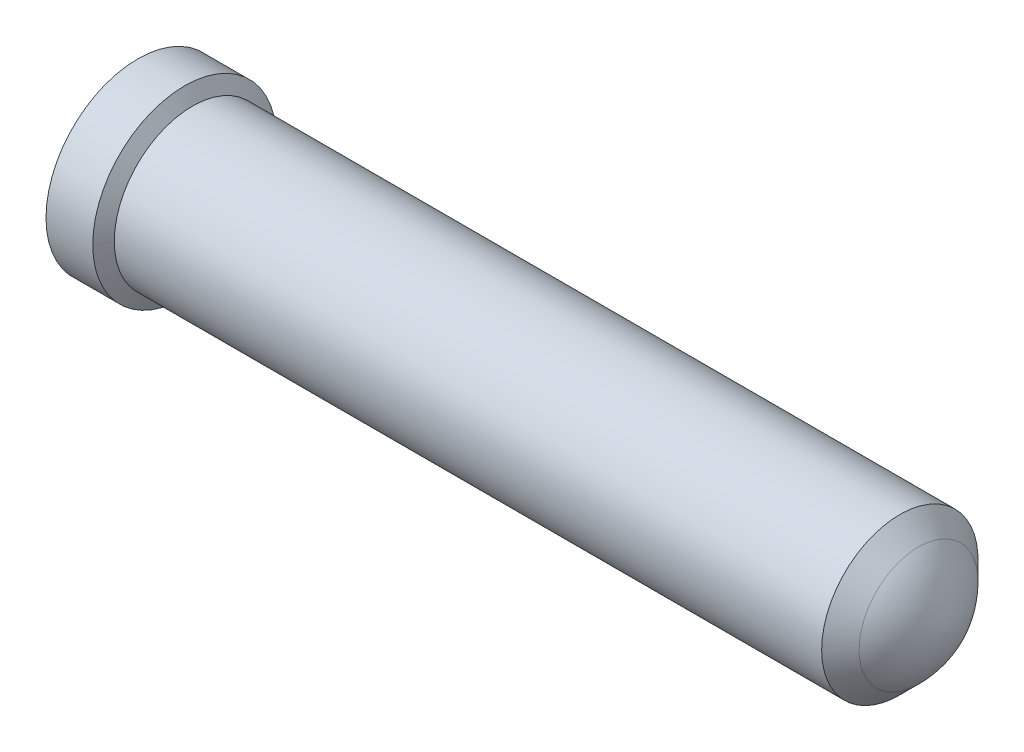
ISO-10303-21;
HEADER;
FILE_DESCRIPTION(('STEP AP214'),'2;1');
FILE_NAME('part.step','',(''),(''),'','','');
FILE_SCHEMA(('AUTOMOTIVE_DESIGN { 1 0 10303 214 1 1 1 1 }'));
ENDSEC;
DATA;
#1=APPLICATION_CONTEXT('core data for automotive mechanical design processes');
#2=APPLICATION_PROTOCOL_DEFINITION('international standard','automotive_design',2000,#1);
#3=PRODUCT_CONTEXT('',#1,'mechanical');
#4=PRODUCT('Part','Part','',(#3));
#5=PRODUCT_RELATED_PRODUCT_CATEGORY('part','',(#4));
#6=PRODUCT_DEFINITION_FORMATION('','',#4);
#7=PRODUCT_DEFINITION_CONTEXT('part definition',#1,'design');
#8=PRODUCT_DEFINITION('design','',#6,#7);
#9=PRODUCT_DEFINITION_SHAPE('','',#8);
#10=(LENGTH_UNIT() NAMED_UNIT(*) SI_UNIT(.MILLI.,.METRE.));
#11=(NAMED_UNIT(*) PLANE_ANGLE_UNIT() SI_UNIT($,.RADIAN.));
#12=(NAMED_UNIT(*) SI_UNIT($,.STERADIAN.) SOLID_ANGLE_UNIT());
#13=UNCERTAINTY_MEASURE_WITH_UNIT(LENGTH_MEASURE(1.E-05),#10,'distance_accuracy_value','');
#14=(GEOMETRIC_REPRESENTATION_CONTEXT(3) GLOBAL_UNCERTAINTY_ASSIGNED_CONTEXT((#13)) GLOBAL_UNIT_ASSIGNED_CONTEXT((#10,
#11,#12)) REPRESENTATION_CONTEXT('',''));
#15=CARTESIAN_POINT('',(0.,0.,0.));
#16=DIRECTION('',(0.,0.,1.));
#17=DIRECTION('',(1.,0.,0.));
#18=AXIS2_PLACEMENT_3D('',#15,#16,#17);
#19=CARTESIAN_POINT('',(4.85300736971013,0.,-0.0451528060534668));
#20=DIRECTION('',(0.,-1.,0.));
#21=DIRECTION('',(0.,0.,1.));
#22=AXIS2_PLACEMENT_3D('',#19,#20,#21);
#23=CIRCLE('',#22,0.635000000000021);
#24=TRIMMED_CURVE('',#23,(PARAMETER_VALUE(-1.49962948747847)),
(PARAMETER_VALUE(1.49962948747847)),.T.,.PARAMETER.);
#25=CARTESIAN_POINT('',(4.85300736971013,0.,0.));
#26=DIRECTION('',(-1.,0.,0.));
#27=AXIS1_PLACEMENT('',#25,#26);
#28=SURFACE_OF_REVOLUTION('',#24,#27);
#29=CARTESIAN_POINT('',(5.3020201757636,0.,0.));
#30=DIRECTION('',(-1.,0.,0.));
#31=DIRECTION('',(0.,0.,1.));
#32=AXIS2_PLACEMENT_3D('',#29,#30,#31);
#33=CIRCLE('',#32,0.403860000000006);
#34=CARTESIAN_POINT('',(5.3020201757636,0.,0.403860000000006));
#35=VERTEX_POINT('',#34);
#36=EDGE_CURVE('E11',#35,#35,#33,.T.);
#37=ORIENTED_EDGE('',*,*,#36,.F.);
#38=EDGE_LOOP('',(#37));
#39=FACE_BOUND('',#38,.T.);
#40=CARTESIAN_POINT('',(5.4864,0.,0.));
#41=VERTEX_POINT('',#40);
#42=VERTEX_LOOP('',#41);
#43=FACE_BOUND('',#42,.T.);
#44=ADVANCED_FACE('F35',(#39,#43),#28,.T.);
#45=CARTESIAN_POINT('',(5.3020201757636,0.,0.));
#46=DIRECTION('',(-1.,0.,0.));
#47=DIRECTION('',(0.,0.,1.));
#48=AXIS2_PLACEMENT_3D('',#45,#46,#47);
#49=CONICAL_SURFACE('',#48,0.403860000000006,0.785398163397448);
#50=CARTESIAN_POINT('',(5.17502017576361,0.,0.));
#51=DIRECTION('',(-1.,0.,0.));
#52=DIRECTION('',(0.,0.,1.));
#53=AXIS2_PLACEMENT_3D('',#50,#51,#52);
#54=CIRCLE('',#53,0.530859999999994);
#55=CARTESIAN_POINT('',(5.17502017576361,0.,0.530859999999994));
#56=VERTEX_POINT('',#55);
#57=EDGE_CURVE('E42',#56,#56,#54,.T.);
#58=ORIENTED_EDGE('',*,*,#57,.F.);
#59=EDGE_LOOP('',(#58));
#60=FACE_BOUND('',#59,.T.);
#61=ORIENTED_EDGE('',*,*,#36,.T.);
#62=EDGE_LOOP('',(#61));
#63=FACE_BOUND('',#62,.T.);
#64=ADVANCED_FACE('F78',(#60,#63),#49,.T.);
#65=CARTESIAN_POINT('',(0.,0.,0.));
#66=DIRECTION('',(-1.,0.,0.));
#67=DIRECTION('',(0.,0.,1.));
#68=AXIS2_PLACEMENT_3D('',#65,#66,#67);
#69=CYLINDRICAL_SURFACE('',#68,0.530859999999994);
#70=CARTESIAN_POINT('',(0.371026143456577,0.,0.));
#71=DIRECTION('',(-1.,0.,0.));
#72=DIRECTION('',(0.,0.,1.));
#73=AXIS2_PLACEMENT_3D('',#70,#71,#72);
#74=CIRCLE('',#73,0.530859999999993);
#75=CARTESIAN_POINT('',(0.371026143456577,0.,0.530859999999993));
#76=VERTEX_POINT('',#75);
#77=EDGE_CURVE('E71',#76,#76,#74,.T.);
#78=ORIENTED_EDGE('',*,*,#77,.F.);
#79=EDGE_LOOP('',(#78));
#80=FACE_BOUND('',#79,.T.);
#81=ORIENTED_EDGE('',*,*,#57,.T.);
#82=EDGE_LOOP('',(#81));
#83=FACE_BOUND('',#82,.T.);
#84=ADVANCED_FACE('F76',(#80,#83),#69,.T.);
#85=CARTESIAN_POINT('',(0.371026143456577,0.,0.));
#86=DIRECTION('',(-1.,0.,0.));
#87=DIRECTION('',(0.,0.,1.));
#88=AXIS2_PLACEMENT_3D('',#85,#86,#87);
#89=CONICAL_SURFACE('',#88,0.530859999999993,1.04719755119674);
#90=CARTESIAN_POINT('',(0.317500000000026,0.,0.));
#91=DIRECTION('',(-1.,0.,0.));
#92=DIRECTION('',(0.,0.,1.));
#93=AXIS2_PLACEMENT_3D('',#90,#91,#92);
#94=CIRCLE('',#93,0.62356999999999);
#95=CARTESIAN_POINT('',(0.317500000000026,0.,0.62356999999999));
#96=VERTEX_POINT('',#95);
#97=EDGE_CURVE('E62',#96,#96,#94,.T.);
#98=ORIENTED_EDGE('',*,*,#97,.F.);
#99=EDGE_LOOP('',(#98));
#100=FACE_BOUND('',#99,.T.);
#101=ORIENTED_EDGE('',*,*,#77,.T.);
#102=EDGE_LOOP('',(#101));
#103=FACE_BOUND('',#102,.T.);
#104=ADVANCED_FACE('F96',(#100,#103),#89,.T.);
#105=CARTESIAN_POINT('',(0.,0.,0.));
#106=DIRECTION('',(-1.,0.,0.));
#107=DIRECTION('',(0.,0.,1.));
#108=AXIS2_PLACEMENT_3D('',#105,#106,#107);
#109=CYLINDRICAL_SURFACE('',#108,0.62356999999999);
#110=CARTESIAN_POINT('',(0.,0.,0.));
#111=DIRECTION('',(-1.,0.,0.));
#112=DIRECTION('',(0.,0.,1.));
#113=AXIS2_PLACEMENT_3D('',#110,#111,#112);
#114=CIRCLE('',#113,0.62356999999999);
#115=CARTESIAN_POINT('',(0.,0.,0.62356999999999));
#116=VERTEX_POINT('',#115);
#117=EDGE_CURVE('E58',#116,#116,#114,.T.);
#118=ORIENTED_EDGE('',*,*,#117,.F.);
#119=EDGE_LOOP('',(#118));
#120=FACE_BOUND('',#119,.T.);
#121=ORIENTED_EDGE('',*,*,#97,.T.);
#122=EDGE_LOOP('',(#121));
#123=FACE_BOUND('',#122,.T.);
#124=ADVANCED_FACE('F104',(#120,#123),#109,.T.);
#125=CARTESIAN_POINT('',(0.,0.,0.));
#126=DIRECTION('',(1.,0.,0.));
#127=DIRECTION('',(0.,0.,-1.));
#128=AXIS2_PLACEMENT_3D('',#125,#126,#127);
#129=PLANE('',#128);
#130=CARTESIAN_POINT('',(0.,0.,0.));
#131=DIRECTION('',(-1.,0.,0.));
#132=DIRECTION('',(0.,0.,1.));
#133=AXIS2_PLACEMENT_3D('',#130,#131,#132);
#134=CIRCLE('',#133,0.546100000000001);
#135=CARTESIAN_POINT('',(0.,0.,0.546100000000001));
#136=VERTEX_POINT('',#135);
#137=EDGE_CURVE('E65',#136,#136,#134,.T.);
#138=ORIENTED_EDGE('',*,*,#137,.F.);
#139=EDGE_LOOP('',(#138));
#140=FACE_BOUND('',#139,.T.);
#141=ORIENTED_EDGE('',*,*,#117,.T.);
#142=EDGE_LOOP('',(#141));
#143=FACE_BOUND('',#142,.T.);
#144=ADVANCED_FACE('F52',(#140,#143),#129,.F.);
#145=CARTESIAN_POINT('',(1.9304,0.,0.));
#146=DIRECTION('',(-1.,0.,0.));
#147=DIRECTION('',(0.,0.,1.));
#148=AXIS2_PLACEMENT_3D('',#145,#146,#147);
#149=CONICAL_SURFACE('',#148,0.457200000000001,1.02974425867666);
#150=CARTESIAN_POINT('',(2.2051134750194,0.,0.));
#151=VERTEX_POINT('',#150);
#152=VERTEX_LOOP('',#151);
#153=FACE_BOUND('',#152,.T.);
#154=CARTESIAN_POINT('',(1.9304,0.,0.));
#155=DIRECTION('',(-1.,0.,0.));
#156=DIRECTION('',(0.,0.,1.));
#157=AXIS2_PLACEMENT_3D('',#154,#155,#156);
#158=CIRCLE('',#157,0.457200000000001);
#159=CARTESIAN_POINT('',(1.9304,0.,0.457200000000001));
#160=VERTEX_POINT('',#159);
#161=EDGE_CURVE('E56',#160,#160,#158,.T.);
#162=ORIENTED_EDGE('',*,*,#161,.T.);
#163=EDGE_LOOP('',(#162));
#164=FACE_BOUND('',#163,.T.);
#165=ADVANCED_FACE('F48',(#153,#164),#149,.F.);
#166=CARTESIAN_POINT('',(0.,0.,0.));
#167=DIRECTION('',(-1.,0.,0.));
#168=DIRECTION('',(0.,0.,1.));
#169=AXIS2_PLACEMENT_3D('',#166,#167,#168);
#170=CYLINDRICAL_SURFACE('',#169,0.457200000000001);
#171=ORIENTED_EDGE('',*,*,#161,.F.);
#172=EDGE_LOOP('',(#171));
#173=FACE_BOUND('',#172,.T.);
#174=CARTESIAN_POINT('',(0.0888999999999998,0.,0.));
#175=DIRECTION('',(-1.,0.,0.));
#176=DIRECTION('',(0.,0.,1.));
#177=AXIS2_PLACEMENT_3D('',#174,#175,#176);
#178=CIRCLE('',#177,0.4572);
#179=CARTESIAN_POINT('',(0.0888999999999998,0.,0.4572));
#180=VERTEX_POINT('',#179);
#181=EDGE_CURVE('E59',#180,#180,#178,.T.);
#182=ORIENTED_EDGE('',*,*,#181,.T.);
#183=EDGE_LOOP('',(#182));
#184=FACE_BOUND('',#183,.T.);
#185=ADVANCED_FACE('F51',(#173,#184),#170,.F.);
#186=CARTESIAN_POINT('',(0.,0.,0.));
#187=DIRECTION('',(-1.,0.,0.));
#188=DIRECTION('',(0.,0.,1.));
#189=AXIS2_PLACEMENT_3D('',#186,#187,#188);
#190=CONICAL_SURFACE('',#189,0.546100000000001,0.785398163397443);
#191=ORIENTED_EDGE('',*,*,#181,.F.);
#192=EDGE_LOOP('',(#191));
#193=FACE_BOUND('',#192,.T.);
#194=ORIENTED_EDGE('',*,*,#137,.T.);
#195=EDGE_LOOP('',(#194));
#196=FACE_BOUND('',#195,.T.);
#197=ADVANCED_FACE('F130',(#193,#196),#190,.F.);
#198=CLOSED_SHELL('',(#44,#64,#84,#104,#124,#144,#165,#185,#197));
#199=MANIFOLD_SOLID_BREP('B2',#198);
#200=ADVANCED_BREP_SHAPE_REPRESENTATION('',(#18,#199),#14);
#201=SHAPE_DEFINITION_REPRESENTATION(#9,#200);
ENDSEC;
END-ISO-10303-21;
